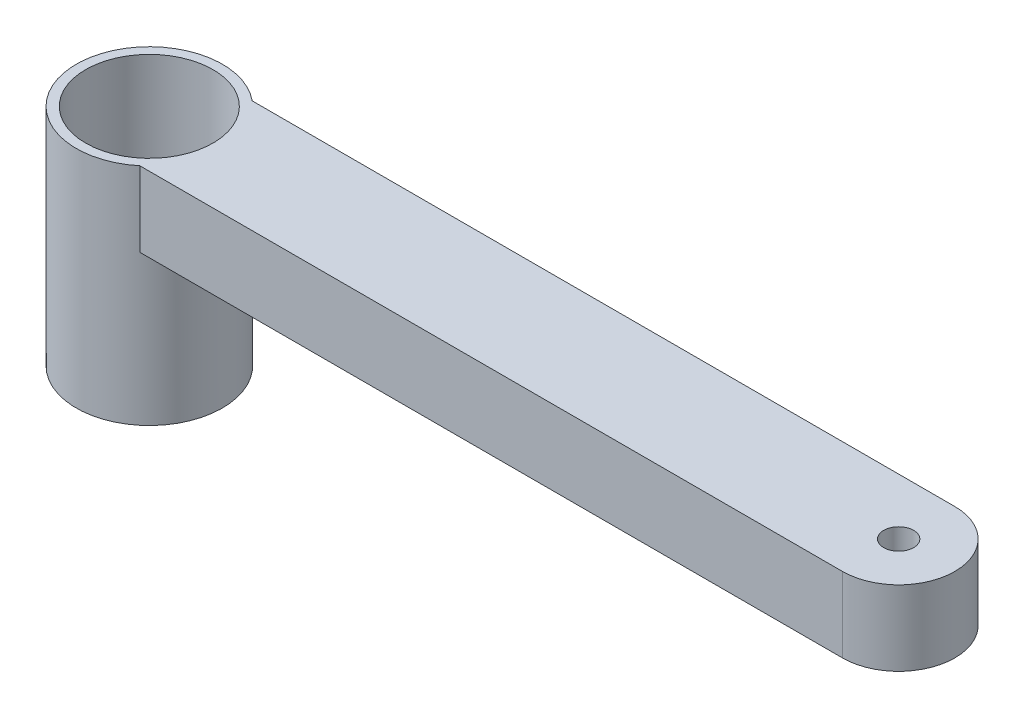
ISO-10303-21;
HEADER;
FILE_DESCRIPTION(('STEP AP214'),'2;1');
FILE_NAME('part.step','',(''),(''),'','','');
FILE_SCHEMA(('AUTOMOTIVE_DESIGN { 1 0 10303 214 1 1 1 1 }'));
ENDSEC;
DATA;
#1=APPLICATION_CONTEXT('core data for automotive mechanical design processes');
#2=APPLICATION_PROTOCOL_DEFINITION('international standard','automotive_design',2000,#1);
#3=PRODUCT_CONTEXT('',#1,'mechanical');
#4=PRODUCT('Part','Part','',(#3));
#5=PRODUCT_RELATED_PRODUCT_CATEGORY('part','',(#4));
#6=PRODUCT_DEFINITION_FORMATION('','',#4);
#7=PRODUCT_DEFINITION_CONTEXT('part definition',#1,'design');
#8=PRODUCT_DEFINITION('design','',#6,#7);
#9=PRODUCT_DEFINITION_SHAPE('','',#8);
#10=(LENGTH_UNIT() NAMED_UNIT(*) SI_UNIT(.MILLI.,.METRE.));
#11=(NAMED_UNIT(*) PLANE_ANGLE_UNIT() SI_UNIT($,.RADIAN.));
#12=(NAMED_UNIT(*) SI_UNIT($,.STERADIAN.) SOLID_ANGLE_UNIT());
#13=UNCERTAINTY_MEASURE_WITH_UNIT(LENGTH_MEASURE(1.E-05),#10,'distance_accuracy_value','');
#14=(GEOMETRIC_REPRESENTATION_CONTEXT(3) GLOBAL_UNCERTAINTY_ASSIGNED_CONTEXT((#13)) GLOBAL_UNIT_ASSIGNED_CONTEXT((#10,
#11,#12)) REPRESENTATION_CONTEXT('',''));
#15=CARTESIAN_POINT('',(0.,0.,0.));
#16=DIRECTION('',(0.,0.,1.));
#17=DIRECTION('',(1.,0.,0.));
#18=AXIS2_PLACEMENT_3D('',#15,#16,#17);
#19=CARTESIAN_POINT('',(0.,10.,7.5));
#20=DIRECTION('',(0.,0.,-1.));
#21=DIRECTION('',(-1.,0.,0.));
#22=AXIS2_PLACEMENT_3D('',#19,#20,#21);
#23=PLANE('',#22);
#24=DIRECTION('',(0.,1.,0.));
#25=VECTOR('',#24,1.);
#26=CARTESIAN_POINT('',(6.22996789718856,-20.,7.5));
#27=LINE('',#26,#25);
#28=CARTESIAN_POINT('',(6.22996789718856,0.,7.5));
#29=VERTEX_POINT('',#28);
#30=CARTESIAN_POINT('',(6.22996789718856,10.,7.5));
#31=VERTEX_POINT('',#30);
#32=EDGE_CURVE('E86',#29,#31,#27,.T.);
#33=ORIENTED_EDGE('',*,*,#32,.F.);
#34=DIRECTION('',(1.,0.,0.));
#35=VECTOR('',#34,1.);
#36=CARTESIAN_POINT('',(0.,0.,7.5));
#37=LINE('',#36,#35);
#38=CARTESIAN_POINT('',(100.,0.,7.5));
#39=VERTEX_POINT('',#38);
#40=EDGE_CURVE('E67',#29,#39,#37,.T.);
#41=ORIENTED_EDGE('',*,*,#40,.T.);
#42=DIRECTION('',(0.,-1.,0.));
#43=VECTOR('',#42,1.);
#44=CARTESIAN_POINT('',(100.,10.,7.5));
#45=LINE('',#44,#43);
#46=CARTESIAN_POINT('',(100.,10.,7.5));
#47=VERTEX_POINT('',#46);
#48=EDGE_CURVE('E48',#47,#39,#45,.T.);
#49=ORIENTED_EDGE('',*,*,#48,.F.);
#50=DIRECTION('',(1.,0.,0.));
#51=VECTOR('',#50,1.);
#52=CARTESIAN_POINT('',(0.,10.,7.5));
#53=LINE('',#52,#51);
#54=EDGE_CURVE('E108',#31,#47,#53,.T.);
#55=ORIENTED_EDGE('',*,*,#54,.F.);
#56=EDGE_LOOP('',(#33,#41,#49,#55));
#57=FACE_BOUND('',#56,.T.);
#58=ADVANCED_FACE('F39',(#57),#23,.F.);
#59=CARTESIAN_POINT('',(0.,10.,-7.5));
#60=DIRECTION('',(0.,0.,1.));
#61=DIRECTION('',(1.,0.,0.));
#62=AXIS2_PLACEMENT_3D('',#59,#60,#61);
#63=PLANE('',#62);
#64=DIRECTION('',(0.,1.,0.));
#65=VECTOR('',#64,1.);
#66=CARTESIAN_POINT('',(6.22996789718856,-20.,-7.5));
#67=LINE('',#66,#65);
#68=CARTESIAN_POINT('',(6.22996789718856,10.,-7.5));
#69=VERTEX_POINT('',#68);
#70=CARTESIAN_POINT('',(6.22996789718856,0.,-7.5));
#71=VERTEX_POINT('',#70);
#72=EDGE_CURVE('E11',#69,#71,#67,.F.);
#73=ORIENTED_EDGE('',*,*,#72,.F.);
#74=DIRECTION('',(-1.,0.,0.));
#75=VECTOR('',#74,1.);
#76=CARTESIAN_POINT('',(0.,10.,-7.5));
#77=LINE('',#76,#75);
#78=CARTESIAN_POINT('',(100.,10.,-7.5));
#79=VERTEX_POINT('',#78);
#80=EDGE_CURVE('E97',#79,#69,#77,.T.);
#81=ORIENTED_EDGE('',*,*,#80,.F.);
#82=DIRECTION('',(0.,-1.,0.));
#83=VECTOR('',#82,1.);
#84=CARTESIAN_POINT('',(100.,10.,-7.5));
#85=LINE('',#84,#83);
#86=CARTESIAN_POINT('',(100.,0.,-7.5));
#87=VERTEX_POINT('',#86);
#88=EDGE_CURVE('E103',#79,#87,#85,.T.);
#89=ORIENTED_EDGE('',*,*,#88,.T.);
#90=DIRECTION('',(-1.,0.,0.));
#91=VECTOR('',#90,1.);
#92=CARTESIAN_POINT('',(0.,0.,-7.5));
#93=LINE('',#92,#91);
#94=EDGE_CURVE('E99',#87,#71,#93,.T.);
#95=ORIENTED_EDGE('',*,*,#94,.T.);
#96=EDGE_LOOP('',(#73,#81,#89,#95));
#97=FACE_BOUND('',#96,.T.);
#98=ADVANCED_FACE('F95',(#97),#63,.F.);
#99=CARTESIAN_POINT('',(0.,10.,0.));
#100=DIRECTION('',(0.,1.,0.));
#101=DIRECTION('',(0.,0.,1.));
#102=AXIS2_PLACEMENT_3D('',#99,#100,#101);
#103=PLANE('',#102);
#104=CARTESIAN_POINT('',(0.,10.,0.));
#105=DIRECTION('',(0.,1.,0.));
#106=DIRECTION('',(0.,0.,1.));
#107=AXIS2_PLACEMENT_3D('',#104,#105,#106);
#108=CIRCLE('',#107,8.5);
#109=CARTESIAN_POINT('',(0.,10.,8.5));
#110=VERTEX_POINT('',#109);
#111=EDGE_CURVE('E90',#110,#110,#108,.T.);
#112=ORIENTED_EDGE('',*,*,#111,.F.);
#113=EDGE_LOOP('',(#112));
#114=FACE_BOUND('',#113,.T.);
#115=ORIENTED_EDGE('',*,*,#80,.T.);
#116=CARTESIAN_POINT('',(0.,10.,0.));
#117=DIRECTION('',(0.,-1.,0.));
#118=DIRECTION('',(0.,0.,-1.));
#119=AXIS2_PLACEMENT_3D('',#116,#117,#118);
#120=CIRCLE('',#119,9.75);
#121=EDGE_CURVE('E83',#31,#69,#120,.T.);
#122=ORIENTED_EDGE('',*,*,#121,.F.);
#123=ORIENTED_EDGE('',*,*,#54,.T.);
#124=CARTESIAN_POINT('',(100.,10.,0.));
#125=DIRECTION('',(0.,1.,0.));
#126=DIRECTION('',(0.,0.,1.));
#127=AXIS2_PLACEMENT_3D('',#124,#125,#126);
#128=CIRCLE('',#127,7.5);
#129=EDGE_CURVE('E56',#47,#79,#128,.T.);
#130=ORIENTED_EDGE('',*,*,#129,.T.);
#131=EDGE_LOOP('',(#115,#122,#123,#130));
#132=FACE_BOUND('',#131,.T.);
#133=CARTESIAN_POINT('',(100.,10.,0.));
#134=DIRECTION('',(0.,1.,0.));
#135=DIRECTION('',(0.,0.,1.));
#136=AXIS2_PLACEMENT_3D('',#133,#134,#135);
#137=CIRCLE('',#136,2.);
#138=CARTESIAN_POINT('',(100.,10.,2.));
#139=VERTEX_POINT('',#138);
#140=EDGE_CURVE('E115',#139,#139,#137,.T.);
#141=ORIENTED_EDGE('',*,*,#140,.F.);
#142=EDGE_LOOP('',(#141));
#143=FACE_BOUND('',#142,.T.);
#144=ADVANCED_FACE('F100',(#114,#132,#143),#103,.T.);
#145=CARTESIAN_POINT('',(0.,0.,0.));
#146=DIRECTION('',(0.,1.,0.));
#147=DIRECTION('',(0.,0.,1.));
#148=AXIS2_PLACEMENT_3D('',#145,#146,#147);
#149=PLANE('',#148);
#150=CARTESIAN_POINT('',(0.,0.,0.));
#151=DIRECTION('',(0.,1.,0.));
#152=DIRECTION('',(0.,0.,1.));
#153=AXIS2_PLACEMENT_3D('',#150,#151,#152);
#154=CIRCLE('',#153,9.75);
#155=EDGE_CURVE('E75',#71,#29,#154,.F.);
#156=ORIENTED_EDGE('',*,*,#155,.F.);
#157=ORIENTED_EDGE('',*,*,#94,.F.);
#158=CARTESIAN_POINT('',(100.,0.,0.));
#159=DIRECTION('',(0.,1.,0.));
#160=DIRECTION('',(0.,0.,1.));
#161=AXIS2_PLACEMENT_3D('',#158,#159,#160);
#162=CIRCLE('',#161,7.5);
#163=EDGE_CURVE('E114',#39,#87,#162,.T.);
#164=ORIENTED_EDGE('',*,*,#163,.F.);
#165=ORIENTED_EDGE('',*,*,#40,.F.);
#166=EDGE_LOOP('',(#156,#157,#164,#165));
#167=FACE_BOUND('',#166,.T.);
#168=CARTESIAN_POINT('',(100.,0.,0.));
#169=DIRECTION('',(0.,1.,0.));
#170=DIRECTION('',(0.,0.,1.));
#171=AXIS2_PLACEMENT_3D('',#168,#169,#170);
#172=CIRCLE('',#171,2.);
#173=CARTESIAN_POINT('',(100.,0.,2.));
#174=VERTEX_POINT('',#173);
#175=EDGE_CURVE('E130',#174,#174,#172,.T.);
#176=ORIENTED_EDGE('',*,*,#175,.T.);
#177=EDGE_LOOP('',(#176));
#178=FACE_BOUND('',#177,.T.);
#179=ADVANCED_FACE('F124',(#167,#178),#149,.F.);
#180=CARTESIAN_POINT('',(100.,10.,0.));
#181=DIRECTION('',(0.,-1.,0.));
#182=DIRECTION('',(0.,0.,-1.));
#183=AXIS2_PLACEMENT_3D('',#180,#181,#182);
#184=CYLINDRICAL_SURFACE('',#183,7.5);
#185=ORIENTED_EDGE('',*,*,#163,.T.);
#186=ORIENTED_EDGE('',*,*,#88,.F.);
#187=ORIENTED_EDGE('',*,*,#129,.F.);
#188=ORIENTED_EDGE('',*,*,#48,.T.);
#189=EDGE_LOOP('',(#185,#186,#187,#188));
#190=FACE_BOUND('',#189,.T.);
#191=ADVANCED_FACE('F122',(#190),#184,.T.);
#192=CARTESIAN_POINT('',(100.,10.,0.));
#193=DIRECTION('',(0.,-1.,0.));
#194=DIRECTION('',(0.,0.,-1.));
#195=AXIS2_PLACEMENT_3D('',#192,#193,#194);
#196=CYLINDRICAL_SURFACE('',#195,2.);
#197=ORIENTED_EDGE('',*,*,#140,.T.);
#198=EDGE_LOOP('',(#197));
#199=FACE_BOUND('',#198,.T.);
#200=ORIENTED_EDGE('',*,*,#175,.F.);
#201=EDGE_LOOP('',(#200));
#202=FACE_BOUND('',#201,.T.);
#203=ADVANCED_FACE('F153',(#199,#202),#196,.F.);
#204=CARTESIAN_POINT('',(0.,-20.,0.));
#205=DIRECTION('',(0.,1.,0.));
#206=DIRECTION('',(0.,0.,1.));
#207=AXIS2_PLACEMENT_3D('',#204,#205,#206);
#208=CYLINDRICAL_SURFACE('',#207,9.75);
#209=CARTESIAN_POINT('',(0.,-20.,0.));
#210=DIRECTION('',(0.,-1.,0.));
#211=DIRECTION('',(0.,0.,-1.));
#212=AXIS2_PLACEMENT_3D('',#209,#210,#211);
#213=CIRCLE('',#212,9.75);
#214=CARTESIAN_POINT('',(0.,-20.,-9.75));
#215=VERTEX_POINT('',#214);
#216=EDGE_CURVE('E89',#215,#215,#213,.T.);
#217=ORIENTED_EDGE('',*,*,#216,.F.);
#218=EDGE_LOOP('',(#217));
#219=FACE_BOUND('',#218,.T.);
#220=ORIENTED_EDGE('',*,*,#155,.T.);
#221=ORIENTED_EDGE('',*,*,#32,.T.);
#222=ORIENTED_EDGE('',*,*,#121,.T.);
#223=ORIENTED_EDGE('',*,*,#72,.T.);
#224=EDGE_LOOP('',(#220,#221,#222,#223));
#225=FACE_BOUND('',#224,.T.);
#226=ADVANCED_FACE('F85',(#219,#225),#208,.T.);
#227=CARTESIAN_POINT('',(0.,-20.,0.));
#228=DIRECTION('',(0.,-1.,0.));
#229=DIRECTION('',(0.,0.,-1.));
#230=AXIS2_PLACEMENT_3D('',#227,#228,#229);
#231=PLANE('',#230);
#232=CARTESIAN_POINT('',(0.,-20.,0.));
#233=DIRECTION('',(0.,-1.,0.));
#234=DIRECTION('',(0.,0.,-1.));
#235=AXIS2_PLACEMENT_3D('',#232,#233,#234);
#236=CIRCLE('',#235,8.5);
#237=CARTESIAN_POINT('',(0.,-20.,-8.5));
#238=VERTEX_POINT('',#237);
#239=EDGE_CURVE('E225',#238,#238,#236,.F.);
#240=ORIENTED_EDGE('',*,*,#239,.T.);
#241=EDGE_LOOP('',(#240));
#242=FACE_BOUND('',#241,.T.);
#243=ORIENTED_EDGE('',*,*,#216,.T.);
#244=EDGE_LOOP('',(#243));
#245=FACE_BOUND('',#244,.T.);
#246=ADVANCED_FACE('F177',(#242,#245),#231,.T.);
#247=CARTESIAN_POINT('',(0.,-20.001,0.));
#248=DIRECTION('',(0.,1.,0.));
#249=DIRECTION('',(0.,0.,1.));
#250=AXIS2_PLACEMENT_3D('',#247,#248,#249);
#251=CYLINDRICAL_SURFACE('',#250,8.5);
#252=ORIENTED_EDGE('',*,*,#239,.F.);
#253=EDGE_LOOP('',(#252));
#254=FACE_BOUND('',#253,.T.);
#255=ORIENTED_EDGE('',*,*,#111,.T.);
#256=EDGE_LOOP('',(#255));
#257=FACE_BOUND('',#256,.T.);
#258=ADVANCED_FACE('F182',(#254,#257),#251,.F.);
#259=CLOSED_SHELL('',(#58,#98,#144,#179,#191,#203,#226,#246,#258));
#260=MANIFOLD_SOLID_BREP('B2',#259);
#261=ADVANCED_BREP_SHAPE_REPRESENTATION('',(#18,#260),#14);
#262=SHAPE_DEFINITION_REPRESENTATION(#9,#261);
ENDSEC;
END-ISO-10303-21;
